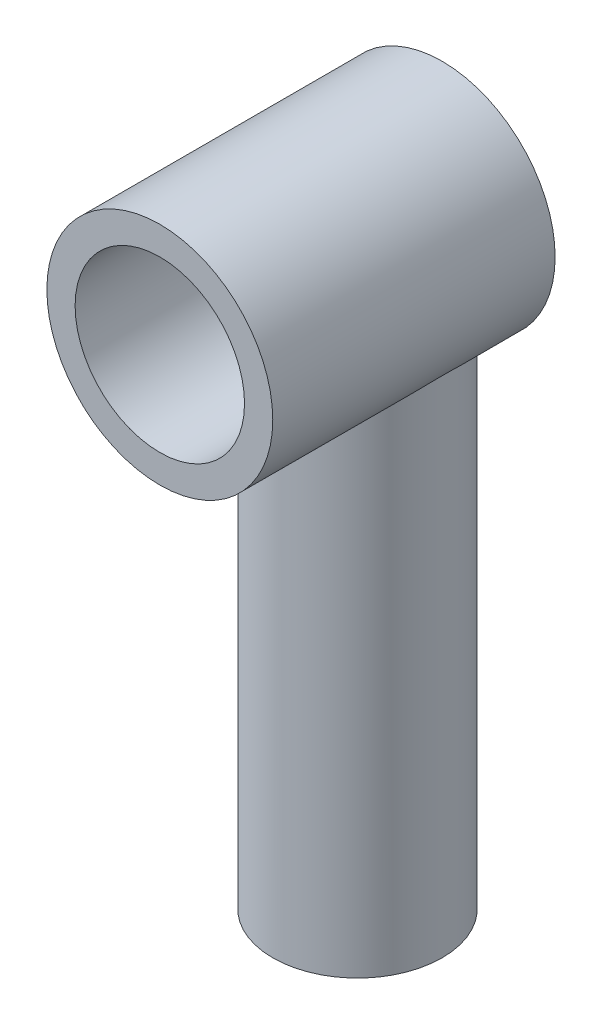
ISO-10303-21;
HEADER;
FILE_DESCRIPTION(('STEP AP214'),'2;1');
FILE_NAME('part.step','',(''),(''),'','','');
FILE_SCHEMA(('AUTOMOTIVE_DESIGN { 1 0 10303 214 1 1 1 1 }'));
ENDSEC;
DATA;
#1=APPLICATION_CONTEXT('core data for automotive mechanical design processes');
#2=APPLICATION_PROTOCOL_DEFINITION('international standard','automotive_design',2000,#1);
#3=PRODUCT_CONTEXT('',#1,'mechanical');
#4=PRODUCT('Part','Part','',(#3));
#5=PRODUCT_RELATED_PRODUCT_CATEGORY('part','',(#4));
#6=PRODUCT_DEFINITION_FORMATION('','',#4);
#7=PRODUCT_DEFINITION_CONTEXT('part definition',#1,'design');
#8=PRODUCT_DEFINITION('design','',#6,#7);
#9=PRODUCT_DEFINITION_SHAPE('','',#8);
#10=(LENGTH_UNIT() NAMED_UNIT(*) SI_UNIT(.MILLI.,.METRE.));
#11=(NAMED_UNIT(*) PLANE_ANGLE_UNIT() SI_UNIT($,.RADIAN.));
#12=(NAMED_UNIT(*) SI_UNIT($,.STERADIAN.) SOLID_ANGLE_UNIT());
#13=UNCERTAINTY_MEASURE_WITH_UNIT(LENGTH_MEASURE(1.E-05),#10,'distance_accuracy_value','');
#14=(GEOMETRIC_REPRESENTATION_CONTEXT(3) GLOBAL_UNCERTAINTY_ASSIGNED_CONTEXT((#13)) GLOBAL_UNIT_ASSIGNED_CONTEXT((#10,
#11,#12)) REPRESENTATION_CONTEXT('',''));
#15=CARTESIAN_POINT('',(0.,0.,0.));
#16=DIRECTION('',(0.,0.,1.));
#17=DIRECTION('',(1.,0.,0.));
#18=AXIS2_PLACEMENT_3D('',#15,#16,#17);
#19=CARTESIAN_POINT('',(0.,-18.,1.));
#20=DIRECTION('',(0.,1.,0.));
#21=DIRECTION('',(0.,0.,1.));
#22=AXIS2_PLACEMENT_3D('',#19,#20,#21);
#23=CYLINDRICAL_SURFACE('',#22,2.);
#24=CARTESIAN_POINT('',(0.,-3.,3.));
#25=CARTESIAN_POINT('',(0.100484716668078,-3.0000004164484,3.00000054963247));
#26=CARTESIAN_POINT('',(0.200969087132901,-2.99490802753388,2.9923860300445));
#27=CARTESIAN_POINT('',(0.398733058031681,-2.97504652423809,2.96240313589434));
#28=CARTESIAN_POINT('',(0.496011113955007,-2.96027281581235,2.94002775687671));
#29=CARTESIAN_POINT('',(0.684212307854249,-2.92250482404708,2.88189228267516));
#30=CARTESIAN_POINT('',(0.775162872657554,-2.89954905493315,2.84619485999206));
#31=CARTESIAN_POINT('',(0.94941529099726,-2.8472613787744,2.7629366367285));
#32=CARTESIAN_POINT('',(1.03271603160967,-2.8179285460551,2.71537411369944));
#33=CARTESIAN_POINT('',(1.19728470077011,-2.75227329369838,2.60534306263257));
#34=CARTESIAN_POINT('',(1.27778030546067,-2.71556897579319,2.54195213925711));
#35=CARTESIAN_POINT('',(1.42772804469274,-2.63982313083466,2.40426995134155));
#36=CARTESIAN_POINT('',(1.49716405543888,-2.60077830356832,2.32996307016226));
#37=CARTESIAN_POINT('',(1.63422297745496,-2.51728264678794,2.15894763238732));
#38=CARTESIAN_POINT('',(1.6998318636275,-2.47295067937795,2.06055434679655));
#39=CARTESIAN_POINT('',(1.81350357014175,-2.3908414735282,1.85163662235347));
#40=CARTESIAN_POINT('',(1.86159673426503,-2.35305295954668,1.74113359843726));
#41=CARTESIAN_POINT('',(1.92674035011438,-2.2997626664146,1.54328870657837));
#42=CARTESIAN_POINT('',(1.94874447236008,-2.28097627892403,1.45847154712609));
#43=CARTESIAN_POINT('',(1.98150617785228,-2.25257969659604,1.28525549525835));
#44=CARTESIAN_POINT('',(1.99228314651963,-2.24295368744147,1.19686305127394));
#45=CARTESIAN_POINT('',(2.00191364141227,-2.23436605608045,1.01852522114353));
#46=CARTESIAN_POINT('',(2.00071842917524,-2.23544802558502,0.928574976547599));
#47=CARTESIAN_POINT('',(1.98637581333356,-2.24819775483425,0.750365026500245));
#48=CARTESIAN_POINT('',(1.97321828380393,-2.25987448286881,0.662106817971867));
#49=CARTESIAN_POINT('',(1.93664994217326,-2.2912718598996,0.493532948758117));
#50=CARTESIAN_POINT('',(1.91371711479477,-2.31061488324375,0.413038664061229));
#51=CARTESIAN_POINT('',(1.85870118583424,-2.35509622933623,0.25697630902422));
#52=CARTESIAN_POINT('',(1.8266150732855,-2.3802364585489,0.181409869761348));
#53=CARTESIAN_POINT('',(1.74673818732648,-2.43964196377947,0.0209746046435569));
#54=CARTESIAN_POINT('',(1.69708052300445,-2.47472317740626,-0.0626599004830954));
#55=CARTESIAN_POINT('',(1.58668960438221,-2.54691537733438,-0.221383395285751));
#56=CARTESIAN_POINT('',(1.52594268999614,-2.58402882709328,-0.296461657762073));
#57=CARTESIAN_POINT('',(1.37981165322309,-2.66543343763724,-0.452542545603418));
#58=CARTESIAN_POINT('',(1.29193938283656,-2.7095474472056,-0.531334048682763));
#59=CARTESIAN_POINT('',(1.10200799908008,-2.79218100665212,-0.673196494538485));
#60=CARTESIAN_POINT('',(0.999962299343696,-2.83070577648042,-0.73628214540898));
#61=CARTESIAN_POINT('',(0.804857827096529,-2.89145404090364,-0.833477718622871));
#62=CARTESIAN_POINT('',(0.713957643371909,-2.9153926116554,-0.870843363338939));
#63=CARTESIAN_POINT('',(0.526036043935479,-2.95507719030499,-0.932104925625368));
#64=CARTESIAN_POINT('',(0.429019879001649,-2.97083012127543,-0.956012227132215));
#65=CARTESIAN_POINT('',(0.23098545317228,-2.99275882156808,-0.989161165237995));
#66=CARTESIAN_POINT('',(0.129951811934157,-2.99889322461187,-0.998339460938263));
#67=CARTESIAN_POINT('',(-0.0724415193893475,-3.00083114965147,-1.00124708856221));
#68=CARTESIAN_POINT('',(-0.173801186186626,-2.99663539385634,-0.994977500488773));
#69=CARTESIAN_POINT('',(-0.36645571720424,-2.97899589424273,-0.968375944438046));
#70=CARTESIAN_POINT('',(-0.457957444679194,-2.96622246390226,-0.949062702244777));
#71=CARTESIAN_POINT('',(-0.636116392427401,-2.93318449284837,-0.898404313987139));
#72=CARTESIAN_POINT('',(-0.722772837571134,-2.91291875746989,-0.867057249071791));
#73=CARTESIAN_POINT('',(-0.894664750465997,-2.86496352529158,-0.791347702955078));
#74=CARTESIAN_POINT('',(-0.97949618463142,-2.83689870135785,-0.746311845918144));
#75=CARTESIAN_POINT('',(-1.14068302395729,-2.77601855611511,-0.645566710053725));
#76=CARTESIAN_POINT('',(-1.21703314820091,-2.74320030403941,-0.58985083946783));
#77=CARTESIAN_POINT('',(-1.37185445482324,-2.6695454665343,-0.45939213184249));
#78=CARTESIAN_POINT('',(-1.44875187569565,-2.62826156800165,-0.383033739924913));
#79=CARTESIAN_POINT('',(-1.58933968069449,-2.54571173085958,-0.218888570042883));
#80=CARTESIAN_POINT('',(-1.6530209365723,-2.50444582417845,-0.131093960892492));
#81=CARTESIAN_POINT('',(-1.76124776549313,-2.4293967897058,0.047142412768127));
#82=CARTESIAN_POINT('',(-1.80695636125283,-2.39527597025701,0.136732033462211));
#83=CARTESIAN_POINT('',(-1.88496213740264,-2.33438974266154,0.323872652443635));
#84=CARTESIAN_POINT('',(-1.91728345682189,-2.30761112529822,0.421408938304627));
#85=CARTESIAN_POINT('',(-1.9623584346534,-2.26933208182633,0.604564487195414));
#86=CARTESIAN_POINT('',(-1.97758597566225,-2.25594998021257,0.689171809876012));
#87=CARTESIAN_POINT('',(-1.99699205923373,-2.23879466438398,0.860573281318386));
#88=CARTESIAN_POINT('',(-2.00118260285317,-2.23501101347816,0.947364951139497));
#89=CARTESIAN_POINT('',(-1.99823921981266,-2.23764201149981,1.1206430567237));
#90=CARTESIAN_POINT('',(-1.99109858767783,-2.24406269907463,1.20712928137376));
#91=CARTESIAN_POINT('',(-1.96596997224746,-2.26610452403491,1.37734352853212));
#92=CARTESIAN_POINT('',(-1.94796751728258,-2.28173793527615,1.46106771382433));
#93=CARTESIAN_POINT('',(-1.89593035657494,-2.32526843904801,1.64571118648124));
#94=CARTESIAN_POINT('',(-1.85890187130765,-2.35532333574983,1.74526771294333));
#95=CARTESIAN_POINT('',(-1.7708452623622,-2.42222161121309,1.93548683438421));
#96=CARTESIAN_POINT('',(-1.71979748341259,-2.459074496867,2.02613669799169));
#97=CARTESIAN_POINT('',(-1.60398280555152,-2.53617186577119,2.19928188713623));
#98=CARTESIAN_POINT('',(-1.53898309894021,-2.5764658739228,2.28159874542305));
#99=CARTESIAN_POINT('',(-1.39671768031094,-2.65628301537844,2.43532247825793));
#100=CARTESIAN_POINT('',(-1.31944821025748,-2.69580590832396,2.50672599702921));
#101=CARTESIAN_POINT('',(-1.14145732976974,-2.77631551964082,2.64671210430908));
#102=CARTESIAN_POINT('',(-1.03896166955574,-2.81669805449991,2.71341864017832));
#103=CARTESIAN_POINT('',(-0.820868555771213,-2.88777665874161,2.8279132766653));
#104=CARTESIAN_POINT('',(-0.705292062449153,-2.91848793445255,2.87573110682395));
#105=CARTESIAN_POINT('',(-0.491435069835742,-2.96101644836895,2.94115457816378));
#106=CARTESIAN_POINT('',(-0.395012325257919,-2.97551480368935,2.96311103909862));
#107=CARTESIAN_POINT('',(-0.199058012023944,-2.99500280141853,2.9925280325381));
#108=CARTESIAN_POINT('',(-0.0995288361880069,-2.99999958751315,2.99999945559601));
#109=CARTESIAN_POINT('',(0.,-3.,3.));
#110=B_SPLINE_CURVE_WITH_KNOTS('',3,(#24,#25,#26,#27,#28,#29,#30,#31,#32,#33,#34,#35,#36,#37,
#38,#39,#40,#41,#42,#43,#44,#45,#46,#47,#48,#49,#50,#51,#52,#53,#54,#55,#56,#57,#58,#59,#60,#61,
#62,#63,#64,#65,#66,#67,#68,#69,#70,#71,#72,#73,#74,#75,#76,#77,#78,#79,#80,#81,#82,#83,#84,#85,
#86,#87,#88,#89,#90,#91,#92,#93,#94,#95,#96,#97,#98,#99,#100,#101,#102,#103,#104,#105,#106,#107,
#108,#109),.UNSPECIFIED.,.T.,.F.,(4,2,2,2,2,2,2,2,2,2,2,2,2,2,2,2,2,2,2,2,2,2,2,2,2,2,2,2,2,2,2,
2,2,2,2,2,2,2,2,2,2,2,4),(0.,0.3010532265054,0.602249414348688,0.902046153190232,
1.20188643867387,1.52717029000557,1.85292411604319,2.23006683295982,2.60655305445439,
2.87433693676029,3.14165767845809,3.41006711735378,3.67870397263352,3.93548862198022,
4.19235783805078,4.50147574660873,4.81097703780057,5.18718954496752,5.56304840301362,
5.86524087696758,6.16717735142813,6.47040883294251,6.77361911533415,7.05553084792472,
7.3374875513827,7.63652346829516,7.93574454945204,8.28228176141291,8.62905753175757,
8.94649935304476,9.26336626640723,9.52324048016134,9.78283200333091,10.0425772028455,
10.302669238524,10.6320660870419,10.9619271337795,11.2977924520448,11.6337608397015,
12.0179535155883,12.4015390656083,12.6999529136674,12.9981423125957),.UNSPECIFIED.);
#111=CARTESIAN_POINT('',(0.,-3.,-0.999999999999999));
#112=VERTEX_POINT('',#111);
#113=EDGE_CURVE('E81',#112,#112,#110,.T.);
#114=ORIENTED_EDGE('',*,*,#113,.T.);
#115=EDGE_LOOP('',(#114));
#116=FACE_BOUND('',#115,.T.);
#117=CARTESIAN_POINT('',(0.,-20.5,1.));
#118=DIRECTION('',(0.,1.,0.));
#119=DIRECTION('',(0.,0.,1.));
#120=AXIS2_PLACEMENT_3D('',#117,#118,#119);
#121=CIRCLE('',#120,2.);
#122=CARTESIAN_POINT('',(0.,-20.5,3.));
#123=VERTEX_POINT('',#122);
#124=EDGE_CURVE('E62',#123,#123,#121,.T.);
#125=ORIENTED_EDGE('',*,*,#124,.F.);
#126=EDGE_LOOP('',(#125));
#127=FACE_BOUND('',#126,.T.);
#128=ADVANCED_FACE('F33',(#116,#127),#23,.F.);
#129=CARTESIAN_POINT('',(0.,-20.5,1.));
#130=DIRECTION('',(0.,1.,0.));
#131=DIRECTION('',(0.,0.,1.));
#132=AXIS2_PLACEMENT_3D('',#129,#130,#131);
#133=CYLINDRICAL_SURFACE('',#132,3.);
#134=CARTESIAN_POINT('',(0.,-4.,4.));
#135=CARTESIAN_POINT('',(-0.0732613677680275,-3.99999929901188,3.99999925798103));
#136=CARTESIAN_POINT('',(-0.146542351053628,-3.99798060344642,3.99730949301313));
#137=CARTESIAN_POINT('',(-0.292508538993505,-3.98996245699389,3.986605139865));
#138=CARTESIAN_POINT('',(-0.365193360793216,-3.98396062416369,3.97858736549519));
#139=CARTESIAN_POINT('',(-0.581731406983922,-3.96012745087107,3.94666409397176));
#140=CARTESIAN_POINT('',(-0.723892660392385,-3.93646888013437,3.91488904200892));
#141=CARTESIAN_POINT('',(-0.998506639011302,-3.87591490407891,3.83257479242475));
#142=CARTESIAN_POINT('',(-1.13101263465653,-3.83910000314071,3.78214965161711));
#143=CARTESIAN_POINT('',(-1.38483526994092,-3.75501017021524,3.66491463306846));
#144=CARTESIAN_POINT('',(-1.50615516858413,-3.70773829853535,3.59810954841649));
#145=CARTESIAN_POINT('',(-1.74693213195157,-3.60099357013528,3.44347627477938));
#146=CARTESIAN_POINT('',(-1.86517631030519,-3.54079623314279,3.35427414872666));
#147=CARTESIAN_POINT('',(-2.08606449940779,-3.41533027981217,3.16099950415699));
#148=CARTESIAN_POINT('',(-2.18868391091458,-3.35005390635213,3.05690402755224));
#149=CARTESIAN_POINT('',(-2.33993228026195,-3.24492237261661,2.87946465589541));
#150=CARTESIAN_POINT('',(-2.39379458304144,-3.2052891581058,2.81036988759055));
#151=CARTESIAN_POINT('',(-2.49548358548255,-3.12676887933752,2.66741086917573));
#152=CARTESIAN_POINT('',(-2.54330846513547,-3.0878820430606,2.59354519094895));
#153=CARTESIAN_POINT('',(-2.63261178619331,-3.01210562553027,2.44122820511978));
#154=CARTESIAN_POINT('',(-2.67409784691839,-2.9752136814322,2.3627825620375));
#155=CARTESIAN_POINT('',(-2.75043132677141,-2.90479339731391,2.20129295245105));
#156=CARTESIAN_POINT('',(-2.78527982077503,-2.87126451310281,2.11824973328609));
#157=CARTESIAN_POINT('',(-2.85760090658949,-2.7995453278082,1.92103772457626));
#158=CARTESIAN_POINT('',(-2.89251037008408,-2.76315561923757,1.80523022606539));
#159=CARTESIAN_POINT('',(-2.94841656316143,-2.70343128888206,1.56720293686586));
#160=CARTESIAN_POINT('',(-2.96944514417499,-2.6800667983994,1.44499852566328));
#161=CARTESIAN_POINT('',(-2.99625559824299,-2.65007535494332,1.19563797552823));
#162=CARTESIAN_POINT('',(-3.00189887157292,-2.6436005765876,1.06844722671663));
#163=CARTESIAN_POINT('',(-2.99696449042943,-2.64919059245027,0.814769337770945));
#164=CARTESIAN_POINT('',(-2.9863810204854,-2.66126203341493,0.688282466205021));
#165=CARTESIAN_POINT('',(-2.95195473462658,-2.69935247502785,0.45361749594042));
#166=CARTESIAN_POINT('',(-2.92964971367057,-2.72374314386008,0.344927309864159));
#167=CARTESIAN_POINT('',(-2.87411343637384,-2.78228385423355,0.133122190551683));
#168=CARTESIAN_POINT('',(-2.84087167817736,-2.81644327194565,0.0300127273860483));
#169=CARTESIAN_POINT('',(-2.74066127604793,-2.91483538729993,-0.232512745687408));
#170=CARTESIAN_POINT('',(-2.6656029678939,-2.9845129831659,-0.386800825883636));
#171=CARTESIAN_POINT('',(-2.49236046828095,-3.13066596252173,-0.678393055159681));
#172=CARTESIAN_POINT('',(-2.39412008565051,-3.20715757761233,-0.815654680515566));
#173=CARTESIAN_POINT('',(-2.17303208149636,-3.36103344637552,-1.07550677875058));
#174=CARTESIAN_POINT('',(-2.04962751039984,-3.43839173465929,-1.19764121323223));
#175=CARTESIAN_POINT('',(-1.78084504353984,-3.58496075956505,-1.42052729409203));
#176=CARTESIAN_POINT('',(-1.63551010852546,-3.65418696517002,-1.52131984052875));
#177=CARTESIAN_POINT('',(-1.3558041609579,-3.76559452155695,-1.6799615984263));
#178=CARTESIAN_POINT('',(-1.2250797406269,-3.81041541916803,-1.74236918857447));
#179=CARTESIAN_POINT('',(-0.952704346148675,-3.88745808807126,-1.84844976078491));
#180=CARTESIAN_POINT('',(-0.811060281155403,-3.91968774910058,-1.89213447637317));
#181=CARTESIAN_POINT('',(-0.51935246594511,-3.96891177371227,-1.9585067264021));
#182=CARTESIAN_POINT('',(-0.369242566477489,-3.98581186314606,-1.98106436025723));
#183=CARTESIAN_POINT('',(-0.0664024759297827,-4.00231766947939,-2.00309919236445));
#184=CARTESIAN_POINT('',(0.0863265824213222,-4.0019306830649,-2.00258612850556));
#185=CARTESIAN_POINT('',(0.373608422358568,-3.98485095596869,-1.97977826944534));
#186=CARTESIAN_POINT('',(0.508444611327581,-3.96980177630784,-1.95967895465771));
#187=CARTESIAN_POINT('',(0.772221384992231,-3.92702635972252,-1.90205241154317));
#188=CARTESIAN_POINT('',(0.901160708783226,-3.89929742534594,-1.8645214748398));
#189=CARTESIAN_POINT('',(1.15483339082487,-3.83199678428177,-1.77222504832849));
#190=CARTESIAN_POINT('',(1.27925770587446,-3.79204165281684,-1.71689805245006));
#191=CARTESIAN_POINT('',(1.51703769337243,-3.70333906113673,-1.59165467378649));
#192=CARTESIAN_POINT('',(1.63039183139361,-3.65459038471486,-1.52173627270122));
#193=CARTESIAN_POINT('',(1.86302046499997,-3.54238575945114,-1.35643531838601));
#194=CARTESIAN_POINT('',(1.98012231440924,-3.47783324856,-1.25875020522045));
#195=CARTESIAN_POINT('',(2.19745073328884,-3.34476768394493,-1.04797519436537));
#196=CARTESIAN_POINT('',(2.29763880438282,-3.27624605925973,-0.934851185336799));
#197=CARTESIAN_POINT('',(2.44323760962616,-3.16783641864784,-0.743170169657539));
#198=CARTESIAN_POINT('',(2.49441207840987,-3.12757855224154,-0.669142141794312));
#199=CARTESIAN_POINT('',(2.59024776181558,-3.04868523124073,-0.516173277872458));
#200=CARTESIAN_POINT('',(2.63490658340164,-3.01005037642925,-0.437230651914548));
#201=CARTESIAN_POINT('',(2.75840992843588,-2.89884735629487,-0.193417131812124));
#202=CARTESIAN_POINT('',(2.8272286655462,-2.83062934493712,-0.0209781238401299));
#203=CARTESIAN_POINT('',(2.91232161832907,-2.74237306217228,0.270846234245375));
#204=CARTESIAN_POINT('',(2.93862206696069,-2.71391502535151,0.384786840491293));
#205=CARTESIAN_POINT('',(2.97782857114492,-2.67084233048459,0.617409516565589));
#206=CARTESIAN_POINT('',(2.99076452454843,-2.65619677881272,0.736080383373083));
#207=CARTESIAN_POINT('',(3.00230698654587,-2.64315167964508,0.97565919506086));
#208=CARTESIAN_POINT('',(3.00084075038308,-2.64483460597191,1.09657541445446));
#209=CARTESIAN_POINT('',(2.98353723231362,-2.66432917886908,1.33611414967831));
#210=CARTESIAN_POINT('',(2.96768140541027,-2.68216163855031,1.45473350382051));
#211=CARTESIAN_POINT('',(2.91787829237152,-2.73634639677126,1.7118255755851));
#212=CARTESIAN_POINT('',(2.88073715900692,-2.77589185811733,1.84897923464056));
#213=CARTESIAN_POINT('',(2.78938673066517,-2.8676615343469,2.11308486170697));
#214=CARTESIAN_POINT('',(2.73513432117033,-2.91991769887725,2.240010031912));
#215=CARTESIAN_POINT('',(2.63161322454641,-3.01293440174583,2.44327247983479));
#216=CARTESIAN_POINT('',(2.58648316812388,-3.05189072454864,2.52261485629528));
#217=CARTESIAN_POINT('',(2.48962257782423,-3.13140535919094,2.67631472353271));
#218=CARTESIAN_POINT('',(2.43789239621905,-3.17196358545147,2.75067248003353));
#219=CARTESIAN_POINT('',(2.32800429973169,-3.25347248479455,2.89435546071041));
#220=CARTESIAN_POINT('',(2.26984095281447,-3.29442346245138,2.96367634876076));
#221=CARTESIAN_POINT('',(2.14725580217517,-3.3756032435117,3.0970201748663));
#222=CARTESIAN_POINT('',(2.08283369004462,-3.41583201121155,3.16104285155734));
#223=CARTESIAN_POINT('',(1.94728190281496,-3.49489651383713,3.28397333307725));
#224=CARTESIAN_POINT('',(1.87609990910415,-3.53371751668994,3.34283308136052));
#225=CARTESIAN_POINT('',(1.72767987087952,-3.60860502556332,3.45432975706269));
#226=CARTESIAN_POINT('',(1.65044310433565,-3.64467210969302,3.50696799179474));
#227=CARTESIAN_POINT('',(1.49030317410492,-3.71302541445825,3.60534194205476));
#228=CARTESIAN_POINT('',(1.40741018139534,-3.74531815238001,3.65108959643198));
#229=CARTESIAN_POINT('',(1.23634243548294,-3.8052164046783,3.73505671604334));
#230=CARTESIAN_POINT('',(1.14817043896907,-3.8328243370667,3.77328006650652));
#231=CARTESIAN_POINT('',(0.929739140257548,-3.89270294176923,3.85556269896704));
#232=CARTESIAN_POINT('',(0.797123031202016,-3.92219862865417,3.8955243628176));
#233=CARTESIAN_POINT('',(0.525667463530595,-3.96768259876897,3.95684487958927));
#234=CARTESIAN_POINT('',(0.38684653813022,-3.9837086019408,3.97825568678842));
#235=CARTESIAN_POINT('',(0.2059280005831,-3.994909382017,3.99320929862348));
#236=CARTESIAN_POINT('',(0.164816108820162,-3.99681576437034,3.99575310282096));
#237=CARTESIAN_POINT('',(0.0824715620593066,-3.99936137264782,3.99914879853168));
#238=CARTESIAN_POINT('',(0.0412388886906549,-4.00000039458683,4.00000041768314));
#239=CARTESIAN_POINT('',(0.,-4.,4.));
#240=B_SPLINE_CURVE_WITH_KNOTS('',3,(#134,#135,#136,#137,#138,#139,#140,#141,#142,#143,#144,
#145,#146,#147,#148,#149,#150,#151,#152,#153,#154,#155,#156,#157,#158,#159,#160,#161,#162,#163,
#164,#165,#166,#167,#168,#169,#170,#171,#172,#173,#174,#175,#176,#177,#178,#179,#180,#181,#182,
#183,#184,#185,#186,#187,#188,#189,#190,#191,#192,#193,#194,#195,#196,#197,#198,#199,#200,#201,
#202,#203,#204,#205,#206,#207,#208,#209,#210,#211,#212,#213,#214,#215,#216,#217,#218,#219,#220,
#221,#222,#223,#224,#225,#226,#227,#228,#229,#230,#231,#232,#233,#234,#235,#236,#237,#238,#239),
.UNSPECIFIED.,.T.,.F.,(4,2,2,2,2,2,2,2,2,2,2,2,2,2,2,2,2,2,2,2,2,2,2,2,2,2,2,2,2,2,2,2,2,2,2,2,
2,2,2,2,2,2,2,2,2,2,2,2,2,2,2,2,4),(0.,0.219733524191398,0.439598569068991,0.879847634771395,
1.31744766307167,1.75491979362349,2.2329036222735,2.71163236402816,2.99983518527188,
3.28812468015057,3.57606487508902,3.86395840178997,4.24151729125786,4.61820678456564,
4.99827867308497,5.37848680666402,5.71806472391401,6.05796967267263,6.61051355677803,
7.16441076781761,7.73224459942164,8.29898017053365,8.75205702078761,9.20484951352218,
9.6604080839978,10.1157743699921,10.5253506608997,10.9350141243761,11.3591357103334,
11.7833160002107,12.2783345622972,12.7744651003689,13.0698938265096,13.3654307846348,
13.9540907813181,14.3138420927746,14.6727868466003,15.033545541411,15.3947698355934,
15.8348522835191,16.2760525671149,16.5734564783343,16.8708445226935,17.1684856206864,
17.466141392762,17.7663250552984,18.0664455283282,18.3660398682404,18.6654791022959,
19.0884486476652,19.5102297424977,19.6338980344064,19.7575862294511),.UNSPECIFIED.);
#241=CARTESIAN_POINT('',(0.,-4.,-2.));
#242=VERTEX_POINT('',#241);
#243=EDGE_CURVE('E56',#242,#242,#240,.T.);
#244=ORIENTED_EDGE('',*,*,#243,.T.);
#245=EDGE_LOOP('',(#244));
#246=FACE_BOUND('',#245,.T.);
#247=CARTESIAN_POINT('',(0.,-20.5,1.));
#248=DIRECTION('',(0.,1.,0.));
#249=DIRECTION('',(0.,0.,1.));
#250=AXIS2_PLACEMENT_3D('',#247,#248,#249);
#251=CIRCLE('',#250,3.);
#252=CARTESIAN_POINT('',(0.,-20.5,4.));
#253=VERTEX_POINT('',#252);
#254=EDGE_CURVE('E58',#253,#253,#251,.T.);
#255=ORIENTED_EDGE('',*,*,#254,.T.);
#256=EDGE_LOOP('',(#255));
#257=FACE_BOUND('',#256,.T.);
#258=ADVANCED_FACE('F68',(#246,#257),#133,.T.);
#259=CARTESIAN_POINT('',(0.,-20.5,1.));
#260=DIRECTION('',(0.,1.,0.));
#261=DIRECTION('',(0.,0.,1.));
#262=AXIS2_PLACEMENT_3D('',#259,#260,#261);
#263=PLANE('',#262);
#264=ORIENTED_EDGE('',*,*,#124,.T.);
#265=EDGE_LOOP('',(#264));
#266=FACE_BOUND('',#265,.T.);
#267=ORIENTED_EDGE('',*,*,#254,.F.);
#268=EDGE_LOOP('',(#267));
#269=FACE_BOUND('',#268,.T.);
#270=ADVANCED_FACE('F73',(#266,#269),#263,.F.);
#271=CARTESIAN_POINT('',(0.,0.,8.));
#272=DIRECTION('',(0.,0.,1.));
#273=DIRECTION('',(1.,0.,0.));
#274=AXIS2_PLACEMENT_3D('',#271,#272,#273);
#275=PLANE('',#274);
#276=CARTESIAN_POINT('',(0.,0.,8.));
#277=DIRECTION('',(0.,0.,1.));
#278=DIRECTION('',(1.,0.,0.));
#279=AXIS2_PLACEMENT_3D('',#276,#277,#278);
#280=CIRCLE('',#279,3.);
#281=CARTESIAN_POINT('',(3.,0.,8.));
#282=VERTEX_POINT('',#281);
#283=EDGE_CURVE('E86',#282,#282,#280,.T.);
#284=ORIENTED_EDGE('',*,*,#283,.F.);
#285=EDGE_LOOP('',(#284));
#286=FACE_BOUND('',#285,.T.);
#287=CARTESIAN_POINT('',(0.,0.,8.));
#288=DIRECTION('',(0.,0.,1.));
#289=DIRECTION('',(1.,0.,0.));
#290=AXIS2_PLACEMENT_3D('',#287,#288,#289);
#291=CIRCLE('',#290,4.);
#292=CARTESIAN_POINT('',(4.,0.,8.));
#293=VERTEX_POINT('',#292);
#294=EDGE_CURVE('E42',#293,#293,#291,.T.);
#295=ORIENTED_EDGE('',*,*,#294,.T.);
#296=EDGE_LOOP('',(#295));
#297=FACE_BOUND('',#296,.T.);
#298=ADVANCED_FACE('F79',(#286,#297),#275,.T.);
#299=CARTESIAN_POINT('',(0.,0.,-2.));
#300=DIRECTION('',(0.,0.,1.));
#301=DIRECTION('',(1.,0.,0.));
#302=AXIS2_PLACEMENT_3D('',#299,#300,#301);
#303=PLANE('',#302);
#304=CARTESIAN_POINT('',(0.,0.,-2.));
#305=DIRECTION('',(0.,0.,1.));
#306=DIRECTION('',(1.,0.,0.));
#307=AXIS2_PLACEMENT_3D('',#304,#305,#306);
#308=CIRCLE('',#307,4.);
#309=EDGE_CURVE('E11',#242,#242,#308,.T.);
#310=ORIENTED_EDGE('',*,*,#309,.F.);
#311=EDGE_LOOP('',(#310));
#312=FACE_BOUND('',#311,.T.);
#313=ADVANCED_FACE('F51',(#312),#303,.F.);
#314=CARTESIAN_POINT('',(0.,0.,-2.));
#315=DIRECTION('',(0.,0.,1.));
#316=DIRECTION('',(1.,0.,0.));
#317=AXIS2_PLACEMENT_3D('',#314,#315,#316);
#318=CYLINDRICAL_SURFACE('',#317,4.);
#319=ORIENTED_EDGE('',*,*,#309,.T.);
#320=ORIENTED_EDGE('',*,*,#243,.F.);
#321=EDGE_LOOP('',(#319,#320));
#322=FACE_BOUND('',#321,.T.);
#323=ORIENTED_EDGE('',*,*,#294,.F.);
#324=EDGE_LOOP('',(#323));
#325=FACE_BOUND('',#324,.T.);
#326=ADVANCED_FACE('F35',(#322,#325),#318,.T.);
#327=CARTESIAN_POINT('',(0.,0.,-0.999999999999999));
#328=DIRECTION('',(0.,0.,1.));
#329=DIRECTION('',(1.,0.,0.));
#330=AXIS2_PLACEMENT_3D('',#327,#328,#329);
#331=CYLINDRICAL_SURFACE('',#330,3.);
#332=ORIENTED_EDGE('',*,*,#283,.T.);
#333=EDGE_LOOP('',(#332));
#334=FACE_BOUND('',#333,.T.);
#335=CARTESIAN_POINT('',(0.,0.,-0.999999999999999));
#336=DIRECTION('',(0.,0.,1.));
#337=DIRECTION('',(1.,0.,0.));
#338=AXIS2_PLACEMENT_3D('',#335,#336,#337);
#339=CIRCLE('',#338,3.);
#340=EDGE_CURVE('E48',#112,#112,#339,.T.);
#341=ORIENTED_EDGE('',*,*,#340,.F.);
#342=ORIENTED_EDGE('',*,*,#113,.F.);
#343=EDGE_LOOP('',(#341,#342));
#344=FACE_BOUND('',#343,.T.);
#345=ADVANCED_FACE('F88',(#334,#344),#331,.F.);
#346=CARTESIAN_POINT('',(0.,0.,-0.999999999999999));
#347=DIRECTION('',(0.,0.,1.));
#348=DIRECTION('',(1.,0.,0.));
#349=AXIS2_PLACEMENT_3D('',#346,#347,#348);
#350=PLANE('',#349);
#351=ORIENTED_EDGE('',*,*,#340,.T.);
#352=EDGE_LOOP('',(#351));
#353=FACE_BOUND('',#352,.T.);
#354=ADVANCED_FACE('F92',(#353),#350,.T.);
#355=CLOSED_SHELL('',(#128,#258,#270,#298,#313,#326,#345,#354));
#356=MANIFOLD_SOLID_BREP('B2',#355);
#357=ADVANCED_BREP_SHAPE_REPRESENTATION('',(#18,#356),#14);
#358=SHAPE_DEFINITION_REPRESENTATION(#9,#357);
ENDSEC;
END-ISO-10303-21;
